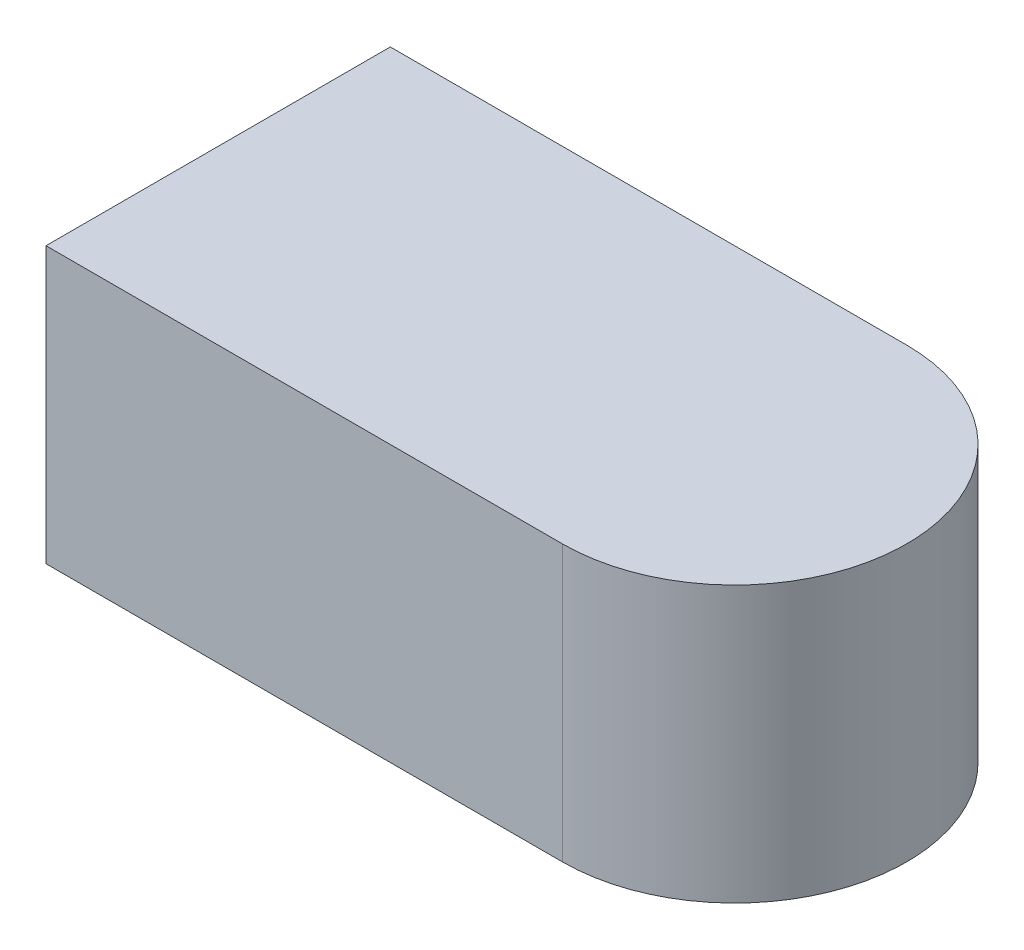
ISO-10303-21;
HEADER;
FILE_DESCRIPTION(('STEP AP214'),'2;1');
FILE_NAME('part.step','',(''),(''),'','','');
FILE_SCHEMA(('AUTOMOTIVE_DESIGN { 1 0 10303 214 1 1 1 1 }'));
ENDSEC;
DATA;
#1=APPLICATION_CONTEXT('core data for automotive mechanical design processes');
#2=APPLICATION_PROTOCOL_DEFINITION('international standard','automotive_design',2000,#1);
#3=PRODUCT_CONTEXT('',#1,'mechanical');
#4=PRODUCT('Part','Part','',(#3));
#5=PRODUCT_RELATED_PRODUCT_CATEGORY('part','',(#4));
#6=PRODUCT_DEFINITION_FORMATION('','',#4);
#7=PRODUCT_DEFINITION_CONTEXT('part definition',#1,'design');
#8=PRODUCT_DEFINITION('design','',#6,#7);
#9=PRODUCT_DEFINITION_SHAPE('','',#8);
#10=(LENGTH_UNIT() NAMED_UNIT(*) SI_UNIT(.MILLI.,.METRE.));
#11=(NAMED_UNIT(*) PLANE_ANGLE_UNIT() SI_UNIT($,.RADIAN.));
#12=(NAMED_UNIT(*) SI_UNIT($,.STERADIAN.) SOLID_ANGLE_UNIT());
#13=UNCERTAINTY_MEASURE_WITH_UNIT(LENGTH_MEASURE(1.E-05),#10,'distance_accuracy_value','');
#14=(GEOMETRIC_REPRESENTATION_CONTEXT(3) GLOBAL_UNCERTAINTY_ASSIGNED_CONTEXT((#13)) GLOBAL_UNIT_ASSIGNED_CONTEXT((#10,
#11,#12)) REPRESENTATION_CONTEXT('',''));
#15=CARTESIAN_POINT('',(0.,0.,0.));
#16=DIRECTION('',(0.,0.,1.));
#17=DIRECTION('',(1.,0.,0.));
#18=AXIS2_PLACEMENT_3D('',#15,#16,#17);
#19=CARTESIAN_POINT('',(0.,0.2,0.));
#20=DIRECTION('',(0.,1.,0.));
#21=DIRECTION('',(0.,0.,1.));
#22=AXIS2_PLACEMENT_3D('',#19,#20,#21);
#23=PLANE('',#22);
#24=DIRECTION('',(-1.,0.,0.));
#25=VECTOR('',#24,1.);
#26=CARTESIAN_POINT('',(-2.125,0.2,-2.125));
#27=LINE('',#26,#25);
#28=CARTESIAN_POINT('',(-2.5,0.2,-2.125));
#29=VERTEX_POINT('',#28);
#30=CARTESIAN_POINT('',(-2.125,0.2,-2.125));
#31=VERTEX_POINT('',#30);
#32=EDGE_CURVE('E45',#29,#31,#27,.F.);
#33=ORIENTED_EDGE('',*,*,#32,.F.);
#34=DIRECTION('',(0.,0.,1.));
#35=VECTOR('',#34,1.);
#36=CARTESIAN_POINT('',(-2.5,0.2,-2.125));
#37=LINE('',#36,#35);
#38=CARTESIAN_POINT('',(-2.5,0.2,-1.875));
#39=VERTEX_POINT('',#38);
#40=EDGE_CURVE('E55',#39,#29,#37,.F.);
#41=ORIENTED_EDGE('',*,*,#40,.F.);
#42=DIRECTION('',(1.,0.,0.));
#43=VECTOR('',#42,1.);
#44=CARTESIAN_POINT('',(-2.5,0.2,-1.875));
#45=LINE('',#44,#43);
#46=CARTESIAN_POINT('',(-2.125,0.2,-1.875));
#47=VERTEX_POINT('',#46);
#48=EDGE_CURVE('E64',#47,#39,#45,.F.);
#49=ORIENTED_EDGE('',*,*,#48,.F.);
#50=CARTESIAN_POINT('',(-2.125,0.2,-2.));
#51=DIRECTION('',(0.,1.,0.));
#52=DIRECTION('',(0.,0.,1.));
#53=AXIS2_PLACEMENT_3D('',#50,#51,#52);
#54=CIRCLE('',#53,0.125);
#55=EDGE_CURVE('E20',#31,#47,#54,.F.);
#56=ORIENTED_EDGE('',*,*,#55,.F.);
#57=EDGE_LOOP('',(#33,#41,#49,#56));
#58=FACE_BOUND('',#57,.T.);
#59=ADVANCED_FACE('F17',(#58),#23,.T.);
#60=CARTESIAN_POINT('',(-2.5,0.,-2.125));
#61=DIRECTION('',(-1.,0.,0.));
#62=DIRECTION('',(0.,0.,1.));
#63=AXIS2_PLACEMENT_3D('',#60,#61,#62);
#64=PLANE('',#63);
#65=DIRECTION('',(0.,1.,0.));
#66=VECTOR('',#65,1.);
#67=CARTESIAN_POINT('',(-2.5,0.,-2.125));
#68=LINE('',#67,#66);
#69=CARTESIAN_POINT('',(-2.5,0.,-2.125));
#70=VERTEX_POINT('',#69);
#71=EDGE_CURVE('E83',#70,#29,#68,.T.);
#72=ORIENTED_EDGE('',*,*,#71,.F.);
#73=DIRECTION('',(0.,0.,1.));
#74=VECTOR('',#73,1.);
#75=CARTESIAN_POINT('',(-2.5,0.,0.));
#76=LINE('',#75,#74);
#77=CARTESIAN_POINT('',(-2.5,0.,-1.875));
#78=VERTEX_POINT('',#77);
#79=EDGE_CURVE('E75',#70,#78,#76,.T.);
#80=ORIENTED_EDGE('',*,*,#79,.T.);
#81=DIRECTION('',(0.,1.,0.));
#82=VECTOR('',#81,1.);
#83=CARTESIAN_POINT('',(-2.5,0.,-1.875));
#84=LINE('',#83,#82);
#85=EDGE_CURVE('E67',#39,#78,#84,.F.);
#86=ORIENTED_EDGE('',*,*,#85,.F.);
#87=ORIENTED_EDGE('',*,*,#40,.T.);
#88=EDGE_LOOP('',(#72,#80,#86,#87));
#89=FACE_BOUND('',#88,.T.);
#90=ADVANCED_FACE('F74',(#89),#64,.T.);
#91=CARTESIAN_POINT('',(-2.5,0.,-1.875));
#92=DIRECTION('',(0.,0.,1.));
#93=DIRECTION('',(1.,0.,0.));
#94=AXIS2_PLACEMENT_3D('',#91,#92,#93);
#95=PLANE('',#94);
#96=ORIENTED_EDGE('',*,*,#85,.T.);
#97=DIRECTION('',(1.,0.,0.));
#98=VECTOR('',#97,1.);
#99=CARTESIAN_POINT('',(0.,0.,-1.875));
#100=LINE('',#99,#98);
#101=CARTESIAN_POINT('',(-2.125,0.,-1.875));
#102=VERTEX_POINT('',#101);
#103=EDGE_CURVE('E90',#78,#102,#100,.T.);
#104=ORIENTED_EDGE('',*,*,#103,.T.);
#105=DIRECTION('',(0.,1.,0.));
#106=VECTOR('',#105,1.);
#107=CARTESIAN_POINT('',(-2.125,0.,-1.875));
#108=LINE('',#107,#106);
#109=EDGE_CURVE('E69',#47,#102,#108,.F.);
#110=ORIENTED_EDGE('',*,*,#109,.F.);
#111=ORIENTED_EDGE('',*,*,#48,.T.);
#112=EDGE_LOOP('',(#96,#104,#110,#111));
#113=FACE_BOUND('',#112,.T.);
#114=ADVANCED_FACE('F65',(#113),#95,.T.);
#115=CARTESIAN_POINT('',(-2.125,0.,-2.));
#116=DIRECTION('',(0.,1.,0.));
#117=DIRECTION('',(0.,0.,1.));
#118=AXIS2_PLACEMENT_3D('',#115,#116,#117);
#119=CYLINDRICAL_SURFACE('',#118,0.125);
#120=ORIENTED_EDGE('',*,*,#109,.T.);
#121=CARTESIAN_POINT('',(-2.125,0.,-2.));
#122=DIRECTION('',(0.,1.,0.));
#123=DIRECTION('',(0.,0.,1.));
#124=AXIS2_PLACEMENT_3D('',#121,#122,#123);
#125=CIRCLE('',#124,0.125);
#126=CARTESIAN_POINT('',(-2.125,0.,-2.125));
#127=VERTEX_POINT('',#126);
#128=EDGE_CURVE('E26',#102,#127,#125,.T.);
#129=ORIENTED_EDGE('',*,*,#128,.T.);
#130=DIRECTION('',(0.,1.,0.));
#131=VECTOR('',#130,1.);
#132=CARTESIAN_POINT('',(-2.125,0.,-2.125));
#133=LINE('',#132,#131);
#134=EDGE_CURVE('E34',#31,#127,#133,.F.);
#135=ORIENTED_EDGE('',*,*,#134,.F.);
#136=ORIENTED_EDGE('',*,*,#55,.T.);
#137=EDGE_LOOP('',(#120,#129,#135,#136));
#138=FACE_BOUND('',#137,.T.);
#139=ADVANCED_FACE('F104',(#138),#119,.T.);
#140=CARTESIAN_POINT('',(-2.125,0.,-2.125));
#141=DIRECTION('',(0.,0.,-1.));
#142=DIRECTION('',(-1.,0.,0.));
#143=AXIS2_PLACEMENT_3D('',#140,#141,#142);
#144=PLANE('',#143);
#145=ORIENTED_EDGE('',*,*,#134,.T.);
#146=DIRECTION('',(1.,0.,0.));
#147=VECTOR('',#146,1.);
#148=CARTESIAN_POINT('',(0.,0.,-2.125));
#149=LINE('',#148,#147);
#150=EDGE_CURVE('E11',#127,#70,#149,.F.);
#151=ORIENTED_EDGE('',*,*,#150,.T.);
#152=ORIENTED_EDGE('',*,*,#71,.T.);
#153=ORIENTED_EDGE('',*,*,#32,.T.);
#154=EDGE_LOOP('',(#145,#151,#152,#153));
#155=FACE_BOUND('',#154,.T.);
#156=ADVANCED_FACE('F107',(#155),#144,.T.);
#157=CARTESIAN_POINT('',(0.,0.,0.));
#158=DIRECTION('',(0.,1.,0.));
#159=DIRECTION('',(0.,0.,1.));
#160=AXIS2_PLACEMENT_3D('',#157,#158,#159);
#161=PLANE('',#160);
#162=ORIENTED_EDGE('',*,*,#128,.F.);
#163=ORIENTED_EDGE('',*,*,#103,.F.);
#164=ORIENTED_EDGE('',*,*,#79,.F.);
#165=ORIENTED_EDGE('',*,*,#150,.F.);
#166=EDGE_LOOP('',(#162,#163,#164,#165));
#167=FACE_BOUND('',#166,.T.);
#168=ADVANCED_FACE('F106',(#167),#161,.F.);
#169=CLOSED_SHELL('',(#59,#90,#114,#139,#156,#168));
#170=MANIFOLD_SOLID_BREP('B1',#169);
#171=ADVANCED_BREP_SHAPE_REPRESENTATION('',(#18,#170),#14);
#172=SHAPE_DEFINITION_REPRESENTATION(#9,#171);
ENDSEC;
END-ISO-10303-21;
